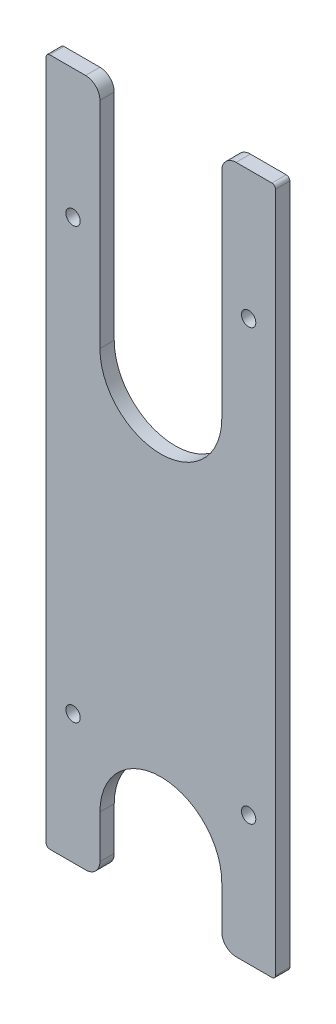
ISO-10303-21;
HEADER;
FILE_DESCRIPTION(('STEP AP214'),'2;1');
FILE_NAME('part.step','',(''),(''),'','','');
FILE_SCHEMA(('AUTOMOTIVE_DESIGN { 1 0 10303 214 1 1 1 1 }'));
ENDSEC;
DATA;
#1=APPLICATION_CONTEXT('core data for automotive mechanical design processes');
#2=APPLICATION_PROTOCOL_DEFINITION('international standard','automotive_design',2000,#1);
#3=PRODUCT_CONTEXT('',#1,'mechanical');
#4=PRODUCT('Part','Part','',(#3));
#5=PRODUCT_RELATED_PRODUCT_CATEGORY('part','',(#4));
#6=PRODUCT_DEFINITION_FORMATION('','',#4);
#7=PRODUCT_DEFINITION_CONTEXT('part definition',#1,'design');
#8=PRODUCT_DEFINITION('design','',#6,#7);
#9=PRODUCT_DEFINITION_SHAPE('','',#8);
#10=(LENGTH_UNIT() NAMED_UNIT(*) SI_UNIT(.MILLI.,.METRE.));
#11=(NAMED_UNIT(*) PLANE_ANGLE_UNIT() SI_UNIT($,.RADIAN.));
#12=(NAMED_UNIT(*) SI_UNIT($,.STERADIAN.) SOLID_ANGLE_UNIT());
#13=UNCERTAINTY_MEASURE_WITH_UNIT(LENGTH_MEASURE(1.E-05),#10,'distance_accuracy_value','');
#14=(GEOMETRIC_REPRESENTATION_CONTEXT(3) GLOBAL_UNCERTAINTY_ASSIGNED_CONTEXT((#13)) GLOBAL_UNIT_ASSIGNED_CONTEXT((#10,
#11,#12)) REPRESENTATION_CONTEXT('',''));
#15=CARTESIAN_POINT('',(0.,0.,0.));
#16=DIRECTION('',(0.,0.,1.));
#17=DIRECTION('',(1.,0.,0.));
#18=AXIS2_PLACEMENT_3D('',#15,#16,#17);
#19=CARTESIAN_POINT('',(26.9875,-152.4,6.35));
#20=DIRECTION('',(0.,1.,0.));
#21=DIRECTION('',(-1.,0.,0.));
#22=AXIS2_PLACEMENT_3D('',#19,#20,#21);
#23=PLANE('',#22);
#24=DIRECTION('',(1.,0.,0.));
#25=VECTOR('',#24,1.);
#26=CARTESIAN_POINT('',(26.9875,-152.4,0.));
#27=LINE('',#26,#25);
#28=CARTESIAN_POINT('',(33.3375,-152.4,0.));
#29=VERTEX_POINT('',#28);
#30=CARTESIAN_POINT('',(49.2124999999999,-152.4,0.));
#31=VERTEX_POINT('',#30);
#32=EDGE_CURVE('E303',#29,#31,#27,.T.);
#33=ORIENTED_EDGE('',*,*,#32,.T.);
#34=DIRECTION('',(0.,0.,-1.));
#35=VECTOR('',#34,1.);
#36=CARTESIAN_POINT('',(49.2124999999999,-152.4,6.35));
#37=LINE('',#36,#35);
#38=CARTESIAN_POINT('',(49.2124999999999,-152.4,6.35));
#39=VERTEX_POINT('',#38);
#40=EDGE_CURVE('E295',#31,#39,#37,.F.);
#41=ORIENTED_EDGE('',*,*,#40,.T.);
#42=DIRECTION('',(1.,0.,0.));
#43=VECTOR('',#42,1.);
#44=CARTESIAN_POINT('',(26.9875,-152.4,6.35));
#45=LINE('',#44,#43);
#46=CARTESIAN_POINT('',(33.3375,-152.4,6.35));
#47=VERTEX_POINT('',#46);
#48=EDGE_CURVE('E237',#47,#39,#45,.T.);
#49=ORIENTED_EDGE('',*,*,#48,.F.);
#50=DIRECTION('',(0.,0.,-1.));
#51=VECTOR('',#50,1.);
#52=CARTESIAN_POINT('',(33.3375,-152.4,6.35));
#53=LINE('',#52,#51);
#54=EDGE_CURVE('E195',#47,#29,#53,.T.);
#55=ORIENTED_EDGE('',*,*,#54,.T.);
#56=EDGE_LOOP('',(#33,#41,#49,#55));
#57=FACE_BOUND('',#56,.T.);
#58=ADVANCED_FACE('F36',(#57),#23,.F.);
#59=CARTESIAN_POINT('',(50.7999999999999,152.4,6.35));
#60=DIRECTION('',(-1.,0.,0.));
#61=DIRECTION('',(0.,0.,1.));
#62=AXIS2_PLACEMENT_3D('',#59,#60,#61);
#63=PLANE('',#62);
#64=DIRECTION('',(0.,1.,0.));
#65=VECTOR('',#64,1.);
#66=CARTESIAN_POINT('',(50.7999999999999,152.4,6.35));
#67=LINE('',#66,#65);
#68=CARTESIAN_POINT('',(50.7999999999999,-150.8125,6.35));
#69=VERTEX_POINT('',#68);
#70=CARTESIAN_POINT('',(50.7999999999999,150.8125,6.35));
#71=VERTEX_POINT('',#70);
#72=EDGE_CURVE('E234',#69,#71,#67,.T.);
#73=ORIENTED_EDGE('',*,*,#72,.F.);
#74=DIRECTION('',(0.,0.,-1.));
#75=VECTOR('',#74,1.);
#76=CARTESIAN_POINT('',(50.7999999999999,-150.8125,6.35));
#77=LINE('',#76,#75);
#78=CARTESIAN_POINT('',(50.7999999999999,-150.8125,0.));
#79=VERTEX_POINT('',#78);
#80=EDGE_CURVE('E292',#69,#79,#77,.T.);
#81=ORIENTED_EDGE('',*,*,#80,.T.);
#82=DIRECTION('',(0.,1.,0.));
#83=VECTOR('',#82,1.);
#84=CARTESIAN_POINT('',(50.7999999999999,152.4,0.));
#85=LINE('',#84,#83);
#86=CARTESIAN_POINT('',(50.7999999999999,150.8125,0.));
#87=VERTEX_POINT('',#86);
#88=EDGE_CURVE('E315',#79,#87,#85,.T.);
#89=ORIENTED_EDGE('',*,*,#88,.T.);
#90=DIRECTION('',(0.,0.,-1.));
#91=VECTOR('',#90,1.);
#92=CARTESIAN_POINT('',(50.7999999999999,150.8125,6.35));
#93=LINE('',#92,#91);
#94=EDGE_CURVE('E290',#87,#71,#93,.F.);
#95=ORIENTED_EDGE('',*,*,#94,.T.);
#96=EDGE_LOOP('',(#73,#81,#89,#95));
#97=FACE_BOUND('',#96,.T.);
#98=ADVANCED_FACE('F314',(#97),#63,.F.);
#99=CARTESIAN_POINT('',(26.9875,152.4,6.35));
#100=DIRECTION('',(0.,-1.,0.));
#101=DIRECTION('',(0.,0.,-1.));
#102=AXIS2_PLACEMENT_3D('',#99,#100,#101);
#103=PLANE('',#102);
#104=DIRECTION('',(-1.,0.,0.));
#105=VECTOR('',#104,1.);
#106=CARTESIAN_POINT('',(26.9875,152.4,6.35));
#107=LINE('',#106,#105);
#108=CARTESIAN_POINT('',(49.2124999999999,152.4,6.35));
#109=VERTEX_POINT('',#108);
#110=CARTESIAN_POINT('',(33.3375,152.4,6.35));
#111=VERTEX_POINT('',#110);
#112=EDGE_CURVE('E186',#109,#111,#107,.T.);
#113=ORIENTED_EDGE('',*,*,#112,.F.);
#114=DIRECTION('',(0.,0.,-1.));
#115=VECTOR('',#114,1.);
#116=CARTESIAN_POINT('',(49.2124999999999,152.4,6.35));
#117=LINE('',#116,#115);
#118=CARTESIAN_POINT('',(49.2124999999999,152.4,0.));
#119=VERTEX_POINT('',#118);
#120=EDGE_CURVE('E12',#109,#119,#117,.T.);
#121=ORIENTED_EDGE('',*,*,#120,.T.);
#122=DIRECTION('',(-1.,0.,0.));
#123=VECTOR('',#122,1.);
#124=CARTESIAN_POINT('',(26.9875,152.4,0.));
#125=LINE('',#124,#123);
#126=CARTESIAN_POINT('',(33.3375,152.4,0.));
#127=VERTEX_POINT('',#126);
#128=EDGE_CURVE('E321',#119,#127,#125,.T.);
#129=ORIENTED_EDGE('',*,*,#128,.T.);
#130=DIRECTION('',(0.,0.,-1.));
#131=VECTOR('',#130,1.);
#132=CARTESIAN_POINT('',(33.3375,152.4,6.35));
#133=LINE('',#132,#131);
#134=EDGE_CURVE('E259',#127,#111,#133,.F.);
#135=ORIENTED_EDGE('',*,*,#134,.T.);
#136=EDGE_LOOP('',(#113,#121,#129,#135));
#137=FACE_BOUND('',#136,.T.);
#138=ADVANCED_FACE('F391',(#137),#103,.F.);
#139=CARTESIAN_POINT('',(26.9875,50.8,6.35));
#140=DIRECTION('',(1.,0.,0.));
#141=DIRECTION('',(0.,1.,0.));
#142=AXIS2_PLACEMENT_3D('',#139,#140,#141);
#143=PLANE('',#142);
#144=DIRECTION('',(0.,-1.,0.));
#145=VECTOR('',#144,1.);
#146=CARTESIAN_POINT('',(26.9875,50.8,6.35));
#147=LINE('',#146,#145);
#148=CARTESIAN_POINT('',(26.9875,146.05,6.35));
#149=VERTEX_POINT('',#148);
#150=CARTESIAN_POINT('',(26.9875,50.8,6.35));
#151=VERTEX_POINT('',#150);
#152=EDGE_CURVE('E173',#149,#151,#147,.T.);
#153=ORIENTED_EDGE('',*,*,#152,.F.);
#154=DIRECTION('',(0.,0.,-1.));
#155=VECTOR('',#154,1.);
#156=CARTESIAN_POINT('',(26.9875,146.05,6.35));
#157=LINE('',#156,#155);
#158=CARTESIAN_POINT('',(26.9875,146.05,0.));
#159=VERTEX_POINT('',#158);
#160=EDGE_CURVE('E257',#149,#159,#157,.T.);
#161=ORIENTED_EDGE('',*,*,#160,.T.);
#162=DIRECTION('',(0.,-1.,0.));
#163=VECTOR('',#162,1.);
#164=CARTESIAN_POINT('',(26.9875,50.8,0.));
#165=LINE('',#164,#163);
#166=CARTESIAN_POINT('',(26.9875,50.8,0.));
#167=VERTEX_POINT('',#166);
#168=EDGE_CURVE('E192',#159,#167,#165,.T.);
#169=ORIENTED_EDGE('',*,*,#168,.T.);
#170=DIRECTION('',(0.,0.,-1.));
#171=VECTOR('',#170,1.);
#172=CARTESIAN_POINT('',(26.9875,50.8,6.35));
#173=LINE('',#172,#171);
#174=EDGE_CURVE('E189',#151,#167,#173,.T.);
#175=ORIENTED_EDGE('',*,*,#174,.F.);
#176=EDGE_LOOP('',(#153,#161,#169,#175));
#177=FACE_BOUND('',#176,.T.);
#178=ADVANCED_FACE('F190',(#177),#143,.F.);
#179=CARTESIAN_POINT('',(0.,50.8,6.35));
#180=DIRECTION('',(0.,0.,-1.));
#181=DIRECTION('',(-1.,0.,0.));
#182=AXIS2_PLACEMENT_3D('',#179,#180,#181);
#183=CYLINDRICAL_SURFACE('',#182,26.9875);
#184=CARTESIAN_POINT('',(0.,50.8,0.));
#185=DIRECTION('',(0.,0.,-1.));
#186=DIRECTION('',(1.,0.,0.));
#187=AXIS2_PLACEMENT_3D('',#184,#185,#186);
#188=CIRCLE('',#187,26.9875);
#189=CARTESIAN_POINT('',(-26.9875,50.8,0.));
#190=VERTEX_POINT('',#189);
#191=EDGE_CURVE('E327',#167,#190,#188,.T.);
#192=ORIENTED_EDGE('',*,*,#191,.T.);
#193=DIRECTION('',(0.,0.,-1.));
#194=VECTOR('',#193,1.);
#195=CARTESIAN_POINT('',(-26.9875,50.8,6.35));
#196=LINE('',#195,#194);
#197=CARTESIAN_POINT('',(-26.9875,50.8,6.35));
#198=VERTEX_POINT('',#197);
#199=EDGE_CURVE('E196',#198,#190,#196,.T.);
#200=ORIENTED_EDGE('',*,*,#199,.F.);
#201=CARTESIAN_POINT('',(0.,50.8,6.35));
#202=DIRECTION('',(0.,0.,-1.));
#203=DIRECTION('',(1.,0.,0.));
#204=AXIS2_PLACEMENT_3D('',#201,#202,#203);
#205=CIRCLE('',#204,26.9875);
#206=EDGE_CURVE('E179',#151,#198,#205,.T.);
#207=ORIENTED_EDGE('',*,*,#206,.F.);
#208=ORIENTED_EDGE('',*,*,#174,.T.);
#209=EDGE_LOOP('',(#192,#200,#207,#208));
#210=FACE_BOUND('',#209,.T.);
#211=ADVANCED_FACE('F198',(#210),#183,.F.);
#212=CARTESIAN_POINT('',(-26.9875,50.8,6.35));
#213=DIRECTION('',(-1.,0.,0.));
#214=DIRECTION('',(0.,-1.,0.));
#215=AXIS2_PLACEMENT_3D('',#212,#213,#214);
#216=PLANE('',#215);
#217=DIRECTION('',(0.,1.,0.));
#218=VECTOR('',#217,1.);
#219=CARTESIAN_POINT('',(-26.9875,50.8,0.));
#220=LINE('',#219,#218);
#221=CARTESIAN_POINT('',(-26.9875,146.05,0.));
#222=VERTEX_POINT('',#221);
#223=EDGE_CURVE('E329',#190,#222,#220,.T.);
#224=ORIENTED_EDGE('',*,*,#223,.T.);
#225=DIRECTION('',(0.,0.,-1.));
#226=VECTOR('',#225,1.);
#227=CARTESIAN_POINT('',(-26.9875,146.05,6.35));
#228=LINE('',#227,#226);
#229=CARTESIAN_POINT('',(-26.9875,146.05,6.35));
#230=VERTEX_POINT('',#229);
#231=EDGE_CURVE('E265',#222,#230,#228,.F.);
#232=ORIENTED_EDGE('',*,*,#231,.T.);
#233=DIRECTION('',(0.,1.,0.));
#234=VECTOR('',#233,1.);
#235=CARTESIAN_POINT('',(-26.9875,50.8,6.35));
#236=LINE('',#235,#234);
#237=EDGE_CURVE('E201',#198,#230,#236,.T.);
#238=ORIENTED_EDGE('',*,*,#237,.F.);
#239=ORIENTED_EDGE('',*,*,#199,.T.);
#240=EDGE_LOOP('',(#224,#232,#238,#239));
#241=FACE_BOUND('',#240,.T.);
#242=ADVANCED_FACE('F401',(#241),#216,.F.);
#243=CARTESIAN_POINT('',(-50.8,152.4,6.35));
#244=DIRECTION('',(0.,-1.,0.));
#245=DIRECTION('',(1.,0.,0.));
#246=AXIS2_PLACEMENT_3D('',#243,#244,#245);
#247=PLANE('',#246);
#248=DIRECTION('',(-1.,0.,0.));
#249=VECTOR('',#248,1.);
#250=CARTESIAN_POINT('',(-50.8,152.4,0.));
#251=LINE('',#250,#249);
#252=CARTESIAN_POINT('',(-33.3375,152.4,0.));
#253=VERTEX_POINT('',#252);
#254=CARTESIAN_POINT('',(-49.2125,152.4,0.));
#255=VERTEX_POINT('',#254);
#256=EDGE_CURVE('E332',#253,#255,#251,.T.);
#257=ORIENTED_EDGE('',*,*,#256,.T.);
#258=DIRECTION('',(0.,0.,-1.));
#259=VECTOR('',#258,1.);
#260=CARTESIAN_POINT('',(-49.2125,152.4,6.35));
#261=LINE('',#260,#259);
#262=CARTESIAN_POINT('',(-49.2125,152.4,6.35));
#263=VERTEX_POINT('',#262);
#264=EDGE_CURVE('E44',#255,#263,#261,.F.);
#265=ORIENTED_EDGE('',*,*,#264,.T.);
#266=DIRECTION('',(-1.,0.,0.));
#267=VECTOR('',#266,1.);
#268=CARTESIAN_POINT('',(-50.8,152.4,6.35));
#269=LINE('',#268,#267);
#270=CARTESIAN_POINT('',(-33.3375,152.4,6.35));
#271=VERTEX_POINT('',#270);
#272=EDGE_CURVE('E203',#271,#263,#269,.T.);
#273=ORIENTED_EDGE('',*,*,#272,.F.);
#274=DIRECTION('',(0.,0.,-1.));
#275=VECTOR('',#274,1.);
#276=CARTESIAN_POINT('',(-33.3375,152.4,6.35));
#277=LINE('',#276,#275);
#278=EDGE_CURVE('E262',#271,#253,#277,.T.);
#279=ORIENTED_EDGE('',*,*,#278,.T.);
#280=EDGE_LOOP('',(#257,#265,#273,#279));
#281=FACE_BOUND('',#280,.T.);
#282=ADVANCED_FACE('F404',(#281),#247,.F.);
#283=CARTESIAN_POINT('',(-50.8,152.4,6.35));
#284=DIRECTION('',(1.,0.,0.));
#285=DIRECTION('',(0.,0.,-1.));
#286=AXIS2_PLACEMENT_3D('',#283,#284,#285);
#287=PLANE('',#286);
#288=DIRECTION('',(0.,-1.,0.));
#289=VECTOR('',#288,1.);
#290=CARTESIAN_POINT('',(-50.8,152.4,0.));
#291=LINE('',#290,#289);
#292=CARTESIAN_POINT('',(-50.8,150.8125,0.));
#293=VERTEX_POINT('',#292);
#294=CARTESIAN_POINT('',(-50.8,-150.8125,0.));
#295=VERTEX_POINT('',#294);
#296=EDGE_CURVE('E334',#293,#295,#291,.T.);
#297=ORIENTED_EDGE('',*,*,#296,.T.);
#298=DIRECTION('',(0.,0.,-1.));
#299=VECTOR('',#298,1.);
#300=CARTESIAN_POINT('',(-50.8,-150.8125,6.35));
#301=LINE('',#300,#299);
#302=CARTESIAN_POINT('',(-50.8,-150.8125,6.35));
#303=VERTEX_POINT('',#302);
#304=EDGE_CURVE('E281',#295,#303,#301,.F.);
#305=ORIENTED_EDGE('',*,*,#304,.T.);
#306=DIRECTION('',(0.,-1.,0.));
#307=VECTOR('',#306,1.);
#308=CARTESIAN_POINT('',(-50.8,152.4,6.35));
#309=LINE('',#308,#307);
#310=CARTESIAN_POINT('',(-50.8,150.8125,6.35));
#311=VERTEX_POINT('',#310);
#312=EDGE_CURVE('E649',#311,#303,#309,.T.);
#313=ORIENTED_EDGE('',*,*,#312,.F.);
#314=DIRECTION('',(0.,0.,-1.));
#315=VECTOR('',#314,1.);
#316=CARTESIAN_POINT('',(-50.8,150.8125,6.35));
#317=LINE('',#316,#315);
#318=EDGE_CURVE('E278',#311,#293,#317,.T.);
#319=ORIENTED_EDGE('',*,*,#318,.T.);
#320=EDGE_LOOP('',(#297,#305,#313,#319));
#321=FACE_BOUND('',#320,.T.);
#322=ADVANCED_FACE('F408',(#321),#287,.F.);
#323=CARTESIAN_POINT('',(-50.8,-152.4,6.35));
#324=DIRECTION('',(0.,1.,0.));
#325=DIRECTION('',(-1.,0.,0.));
#326=AXIS2_PLACEMENT_3D('',#323,#324,#325);
#327=PLANE('',#326);
#328=DIRECTION('',(1.,0.,0.));
#329=VECTOR('',#328,1.);
#330=CARTESIAN_POINT('',(-50.8,-152.4,6.35));
#331=LINE('',#330,#329);
#332=CARTESIAN_POINT('',(-49.2125,-152.4,6.35));
#333=VERTEX_POINT('',#332);
#334=CARTESIAN_POINT('',(-33.3375,-152.4,6.35));
#335=VERTEX_POINT('',#334);
#336=EDGE_CURVE('E651',#333,#335,#331,.T.);
#337=ORIENTED_EDGE('',*,*,#336,.F.);
#338=DIRECTION('',(0.,0.,-1.));
#339=VECTOR('',#338,1.);
#340=CARTESIAN_POINT('',(-49.2125,-152.4,6.35));
#341=LINE('',#340,#339);
#342=CARTESIAN_POINT('',(-49.2125,-152.4,0.));
#343=VERTEX_POINT('',#342);
#344=EDGE_CURVE('E267',#333,#343,#341,.T.);
#345=ORIENTED_EDGE('',*,*,#344,.T.);
#346=DIRECTION('',(1.,0.,0.));
#347=VECTOR('',#346,1.);
#348=CARTESIAN_POINT('',(-50.8,-152.4,0.));
#349=LINE('',#348,#347);
#350=CARTESIAN_POINT('',(-33.3375,-152.4,0.));
#351=VERTEX_POINT('',#350);
#352=EDGE_CURVE('E337',#343,#351,#349,.T.);
#353=ORIENTED_EDGE('',*,*,#352,.T.);
#354=DIRECTION('',(0.,0.,-1.));
#355=VECTOR('',#354,1.);
#356=CARTESIAN_POINT('',(-33.3375,-152.4,6.35));
#357=LINE('',#356,#355);
#358=EDGE_CURVE('E254',#351,#335,#357,.F.);
#359=ORIENTED_EDGE('',*,*,#358,.T.);
#360=EDGE_LOOP('',(#337,#345,#353,#359));
#361=FACE_BOUND('',#360,.T.);
#362=ADVANCED_FACE('F411',(#361),#327,.F.);
#363=CARTESIAN_POINT('',(-26.9875,-127.,6.35));
#364=DIRECTION('',(-1.,0.,0.));
#365=DIRECTION('',(0.,-1.,0.));
#366=AXIS2_PLACEMENT_3D('',#363,#364,#365);
#367=PLANE('',#366);
#368=DIRECTION('',(0.,1.,0.));
#369=VECTOR('',#368,1.);
#370=CARTESIAN_POINT('',(-26.9875,-127.,6.35));
#371=LINE('',#370,#369);
#372=CARTESIAN_POINT('',(-26.9875,-146.05,6.35));
#373=VERTEX_POINT('',#372);
#374=CARTESIAN_POINT('',(-26.9875,-127.,6.35));
#375=VERTEX_POINT('',#374);
#376=EDGE_CURVE('E653',#373,#375,#371,.T.);
#377=ORIENTED_EDGE('',*,*,#376,.F.);
#378=DIRECTION('',(0.,0.,-1.));
#379=VECTOR('',#378,1.);
#380=CARTESIAN_POINT('',(-26.9875,-146.05,6.35));
#381=LINE('',#380,#379);
#382=CARTESIAN_POINT('',(-26.9875,-146.05,0.));
#383=VERTEX_POINT('',#382);
#384=EDGE_CURVE('E251',#373,#383,#381,.T.);
#385=ORIENTED_EDGE('',*,*,#384,.T.);
#386=DIRECTION('',(0.,1.,0.));
#387=VECTOR('',#386,1.);
#388=CARTESIAN_POINT('',(-26.9875,-127.,0.));
#389=LINE('',#388,#387);
#390=CARTESIAN_POINT('',(-26.9875,-127.,0.));
#391=VERTEX_POINT('',#390);
#392=EDGE_CURVE('E339',#383,#391,#389,.T.);
#393=ORIENTED_EDGE('',*,*,#392,.T.);
#394=DIRECTION('',(0.,0.,-1.));
#395=VECTOR('',#394,1.);
#396=CARTESIAN_POINT('',(-26.9875,-127.,6.35));
#397=LINE('',#396,#395);
#398=EDGE_CURVE('E348',#375,#391,#397,.T.);
#399=ORIENTED_EDGE('',*,*,#398,.F.);
#400=EDGE_LOOP('',(#377,#385,#393,#399));
#401=FACE_BOUND('',#400,.T.);
#402=ADVANCED_FACE('F415',(#401),#367,.F.);
#403=CARTESIAN_POINT('',(0.,-127.,6.35));
#404=DIRECTION('',(0.,0.,-1.));
#405=DIRECTION('',(-1.,0.,0.));
#406=AXIS2_PLACEMENT_3D('',#403,#404,#405);
#407=CYLINDRICAL_SURFACE('',#406,26.9875);
#408=CARTESIAN_POINT('',(0.,-127.,0.));
#409=DIRECTION('',(0.,0.,-1.));
#410=DIRECTION('',(1.,0.,0.));
#411=AXIS2_PLACEMENT_3D('',#408,#409,#410);
#412=CIRCLE('',#411,26.9875);
#413=CARTESIAN_POINT('',(26.9875,-127.,0.));
#414=VERTEX_POINT('',#413);
#415=EDGE_CURVE('E341',#391,#414,#412,.T.);
#416=ORIENTED_EDGE('',*,*,#415,.T.);
#417=DIRECTION('',(0.,0.,-1.));
#418=VECTOR('',#417,1.);
#419=CARTESIAN_POINT('',(26.9875,-127.,6.35));
#420=LINE('',#419,#418);
#421=CARTESIAN_POINT('',(26.9875,-127.,6.35));
#422=VERTEX_POINT('',#421);
#423=EDGE_CURVE('E345',#422,#414,#420,.T.);
#424=ORIENTED_EDGE('',*,*,#423,.F.);
#425=CARTESIAN_POINT('',(0.,-127.,6.35));
#426=DIRECTION('',(0.,0.,-1.));
#427=DIRECTION('',(1.,0.,0.));
#428=AXIS2_PLACEMENT_3D('',#425,#426,#427);
#429=CIRCLE('',#428,26.9875);
#430=EDGE_CURVE('E369',#375,#422,#429,.T.);
#431=ORIENTED_EDGE('',*,*,#430,.F.);
#432=ORIENTED_EDGE('',*,*,#398,.T.);
#433=EDGE_LOOP('',(#416,#424,#431,#432));
#434=FACE_BOUND('',#433,.T.);
#435=ADVANCED_FACE('F419',(#434),#407,.F.);
#436=CARTESIAN_POINT('',(26.9875,-127.,6.35));
#437=DIRECTION('',(1.,0.,0.));
#438=DIRECTION('',(0.,1.,0.));
#439=AXIS2_PLACEMENT_3D('',#436,#437,#438);
#440=PLANE('',#439);
#441=DIRECTION('',(0.,-1.,0.));
#442=VECTOR('',#441,1.);
#443=CARTESIAN_POINT('',(26.9875,-127.,0.));
#444=LINE('',#443,#442);
#445=CARTESIAN_POINT('',(26.9875,-146.05,0.));
#446=VERTEX_POINT('',#445);
#447=EDGE_CURVE('E241',#414,#446,#444,.T.);
#448=ORIENTED_EDGE('',*,*,#447,.T.);
#449=DIRECTION('',(0.,0.,-1.));
#450=VECTOR('',#449,1.);
#451=CARTESIAN_POINT('',(26.9875,-146.05,6.35));
#452=LINE('',#451,#450);
#453=CARTESIAN_POINT('',(26.9875,-146.05,6.35));
#454=VERTEX_POINT('',#453);
#455=EDGE_CURVE('E222',#446,#454,#452,.F.);
#456=ORIENTED_EDGE('',*,*,#455,.T.);
#457=DIRECTION('',(0.,-1.,0.));
#458=VECTOR('',#457,1.);
#459=CARTESIAN_POINT('',(26.9875,-127.,6.35));
#460=LINE('',#459,#458);
#461=EDGE_CURVE('E349',#422,#454,#460,.T.);
#462=ORIENTED_EDGE('',*,*,#461,.F.);
#463=ORIENTED_EDGE('',*,*,#423,.T.);
#464=EDGE_LOOP('',(#448,#456,#462,#463));
#465=FACE_BOUND('',#464,.T.);
#466=ADVANCED_FACE('F366',(#465),#440,.F.);
#467=CARTESIAN_POINT('',(0.,50.8,6.35));
#468=DIRECTION('',(0.,0.,1.));
#469=DIRECTION('',(1.,0.,0.));
#470=AXIS2_PLACEMENT_3D('',#467,#468,#469);
#471=PLANE('',#470);
#472=CARTESIAN_POINT('',(-38.89375,95.25,6.35));
#473=DIRECTION('',(0.,0.,1.));
#474=DIRECTION('',(1.,0.,0.));
#475=AXIS2_PLACEMENT_3D('',#472,#473,#474);
#476=CIRCLE('',#475,3.175);
#477=CARTESIAN_POINT('',(-35.71875,95.25,6.35));
#478=VERTEX_POINT('',#477);
#479=EDGE_CURVE('E457',#478,#478,#476,.T.);
#480=ORIENTED_EDGE('',*,*,#479,.F.);
#481=EDGE_LOOP('',(#480));
#482=FACE_BOUND('',#481,.T.);
#483=CARTESIAN_POINT('',(38.89375,95.25,6.35));
#484=DIRECTION('',(0.,0.,1.));
#485=DIRECTION('',(1.,0.,0.));
#486=AXIS2_PLACEMENT_3D('',#483,#484,#485);
#487=CIRCLE('',#486,3.175);
#488=CARTESIAN_POINT('',(42.06875,95.25,6.35));
#489=VERTEX_POINT('',#488);
#490=EDGE_CURVE('E450',#489,#489,#487,.T.);
#491=ORIENTED_EDGE('',*,*,#490,.F.);
#492=EDGE_LOOP('',(#491));
#493=FACE_BOUND('',#492,.T.);
#494=CARTESIAN_POINT('',(38.89375,-95.25,6.35));
#495=DIRECTION('',(0.,0.,1.));
#496=DIRECTION('',(1.,0.,0.));
#497=AXIS2_PLACEMENT_3D('',#494,#495,#496);
#498=CIRCLE('',#497,3.175);
#499=CARTESIAN_POINT('',(42.06875,-95.25,6.35));
#500=VERTEX_POINT('',#499);
#501=EDGE_CURVE('E454',#500,#500,#498,.T.);
#502=ORIENTED_EDGE('',*,*,#501,.F.);
#503=EDGE_LOOP('',(#502));
#504=FACE_BOUND('',#503,.T.);
#505=CARTESIAN_POINT('',(-38.89375,-95.25,6.35));
#506=DIRECTION('',(0.,0.,1.));
#507=DIRECTION('',(1.,0.,0.));
#508=AXIS2_PLACEMENT_3D('',#505,#506,#507);
#509=CIRCLE('',#508,3.175);
#510=CARTESIAN_POINT('',(-35.71875,-95.25,6.35));
#511=VERTEX_POINT('',#510);
#512=EDGE_CURVE('E470',#511,#511,#509,.T.);
#513=ORIENTED_EDGE('',*,*,#512,.F.);
#514=EDGE_LOOP('',(#513));
#515=FACE_BOUND('',#514,.T.);
#516=ORIENTED_EDGE('',*,*,#312,.T.);
#517=CARTESIAN_POINT('',(-49.2125,-150.8125,6.35));
#518=DIRECTION('',(0.,0.,1.));
#519=DIRECTION('',(1.,0.,0.));
#520=AXIS2_PLACEMENT_3D('',#517,#518,#519);
#521=CIRCLE('',#520,1.5875);
#522=EDGE_CURVE('E288',#303,#333,#521,.T.);
#523=ORIENTED_EDGE('',*,*,#522,.T.);
#524=ORIENTED_EDGE('',*,*,#336,.T.);
#525=CARTESIAN_POINT('',(-33.3375,-146.05,6.35));
#526=DIRECTION('',(0.,0.,1.));
#527=DIRECTION('',(1.,0.,0.));
#528=AXIS2_PLACEMENT_3D('',#525,#526,#527);
#529=CIRCLE('',#528,6.35);
#530=EDGE_CURVE('E226',#335,#373,#529,.T.);
#531=ORIENTED_EDGE('',*,*,#530,.T.);
#532=ORIENTED_EDGE('',*,*,#376,.T.);
#533=ORIENTED_EDGE('',*,*,#430,.T.);
#534=ORIENTED_EDGE('',*,*,#461,.T.);
#535=CARTESIAN_POINT('',(33.3375,-146.05,6.35));
#536=DIRECTION('',(0.,0.,1.));
#537=DIRECTION('',(1.,0.,0.));
#538=AXIS2_PLACEMENT_3D('',#535,#536,#537);
#539=CIRCLE('',#538,6.35);
#540=EDGE_CURVE('E248',#454,#47,#539,.T.);
#541=ORIENTED_EDGE('',*,*,#540,.T.);
#542=ORIENTED_EDGE('',*,*,#48,.T.);
#543=CARTESIAN_POINT('',(49.2124999999999,-150.8125,6.35));
#544=DIRECTION('',(0.,0.,1.));
#545=DIRECTION('',(1.,0.,0.));
#546=AXIS2_PLACEMENT_3D('',#543,#544,#545);
#547=CIRCLE('',#546,1.5875);
#548=EDGE_CURVE('E286',#39,#69,#547,.T.);
#549=ORIENTED_EDGE('',*,*,#548,.T.);
#550=ORIENTED_EDGE('',*,*,#72,.T.);
#551=CARTESIAN_POINT('',(49.2124999999999,150.8125,6.35));
#552=DIRECTION('',(0.,0.,1.));
#553=DIRECTION('',(1.,0.,0.));
#554=AXIS2_PLACEMENT_3D('',#551,#552,#553);
#555=CIRCLE('',#554,1.5875);
#556=EDGE_CURVE('E58',#71,#109,#555,.T.);
#557=ORIENTED_EDGE('',*,*,#556,.T.);
#558=ORIENTED_EDGE('',*,*,#112,.T.);
#559=CARTESIAN_POINT('',(33.3375,146.05,6.35));
#560=DIRECTION('',(0.,0.,1.));
#561=DIRECTION('',(1.,0.,0.));
#562=AXIS2_PLACEMENT_3D('',#559,#560,#561);
#563=CIRCLE('',#562,6.35);
#564=EDGE_CURVE('E182',#111,#149,#563,.T.);
#565=ORIENTED_EDGE('',*,*,#564,.T.);
#566=ORIENTED_EDGE('',*,*,#152,.T.);
#567=ORIENTED_EDGE('',*,*,#206,.T.);
#568=ORIENTED_EDGE('',*,*,#237,.T.);
#569=CARTESIAN_POINT('',(-33.3375,146.05,6.35));
#570=DIRECTION('',(0.,0.,1.));
#571=DIRECTION('',(1.,0.,0.));
#572=AXIS2_PLACEMENT_3D('',#569,#570,#571);
#573=CIRCLE('',#572,6.35);
#574=EDGE_CURVE('E218',#230,#271,#573,.T.);
#575=ORIENTED_EDGE('',*,*,#574,.T.);
#576=ORIENTED_EDGE('',*,*,#272,.T.);
#577=CARTESIAN_POINT('',(-49.2125,150.8125,6.35));
#578=DIRECTION('',(0.,0.,1.));
#579=DIRECTION('',(1.,0.,0.));
#580=AXIS2_PLACEMENT_3D('',#577,#578,#579);
#581=CIRCLE('',#580,1.5875);
#582=EDGE_CURVE('E284',#263,#311,#581,.T.);
#583=ORIENTED_EDGE('',*,*,#582,.T.);
#584=EDGE_LOOP('',(#516,#523,#524,#531,#532,#533,#534,#541,#542,#549,#550,#557,#558,#565,#566,
#567,#568,#575,#576,#583));
#585=FACE_BOUND('',#584,.T.);
#586=ADVANCED_FACE('F176',(#482,#493,#504,#515,#585),#471,.T.);
#587=CARTESIAN_POINT('',(0.,50.8,0.));
#588=DIRECTION('',(0.,0.,1.));
#589=DIRECTION('',(1.,0.,0.));
#590=AXIS2_PLACEMENT_3D('',#587,#588,#589);
#591=PLANE('',#590);
#592=CARTESIAN_POINT('',(-38.89375,95.25,0.));
#593=DIRECTION('',(0.,0.,1.));
#594=DIRECTION('',(1.,0.,0.));
#595=AXIS2_PLACEMENT_3D('',#592,#593,#594);
#596=CIRCLE('',#595,3.175);
#597=CARTESIAN_POINT('',(-35.71875,95.25,0.));
#598=VERTEX_POINT('',#597);
#599=EDGE_CURVE('E452',#598,#598,#596,.T.);
#600=ORIENTED_EDGE('',*,*,#599,.T.);
#601=EDGE_LOOP('',(#600));
#602=FACE_BOUND('',#601,.T.);
#603=CARTESIAN_POINT('',(38.89375,95.25,0.));
#604=DIRECTION('',(0.,0.,1.));
#605=DIRECTION('',(1.,0.,0.));
#606=AXIS2_PLACEMENT_3D('',#603,#604,#605);
#607=CIRCLE('',#606,3.175);
#608=CARTESIAN_POINT('',(42.06875,95.25,0.));
#609=VERTEX_POINT('',#608);
#610=EDGE_CURVE('E447',#609,#609,#607,.T.);
#611=ORIENTED_EDGE('',*,*,#610,.T.);
#612=EDGE_LOOP('',(#611));
#613=FACE_BOUND('',#612,.T.);
#614=CARTESIAN_POINT('',(38.89375,-95.25,0.));
#615=DIRECTION('',(0.,0.,1.));
#616=DIRECTION('',(1.,0.,0.));
#617=AXIS2_PLACEMENT_3D('',#614,#615,#616);
#618=CIRCLE('',#617,3.175);
#619=CARTESIAN_POINT('',(42.06875,-95.25,0.));
#620=VERTEX_POINT('',#619);
#621=EDGE_CURVE('E468',#620,#620,#618,.T.);
#622=ORIENTED_EDGE('',*,*,#621,.T.);
#623=EDGE_LOOP('',(#622));
#624=FACE_BOUND('',#623,.T.);
#625=CARTESIAN_POINT('',(-38.89375,-95.25,0.));
#626=DIRECTION('',(0.,0.,1.));
#627=DIRECTION('',(1.,0.,0.));
#628=AXIS2_PLACEMENT_3D('',#625,#626,#627);
#629=CIRCLE('',#628,3.175);
#630=CARTESIAN_POINT('',(-35.71875,-95.25,0.));
#631=VERTEX_POINT('',#630);
#632=EDGE_CURVE('E242',#631,#631,#629,.T.);
#633=ORIENTED_EDGE('',*,*,#632,.T.);
#634=EDGE_LOOP('',(#633));
#635=FACE_BOUND('',#634,.T.);
#636=ORIENTED_EDGE('',*,*,#352,.F.);
#637=CARTESIAN_POINT('',(-49.2125,-150.8125,0.));
#638=DIRECTION('',(0.,0.,1.));
#639=DIRECTION('',(1.,0.,0.));
#640=AXIS2_PLACEMENT_3D('',#637,#638,#639);
#641=CIRCLE('',#640,1.5875);
#642=EDGE_CURVE('E276',#343,#295,#641,.F.);
#643=ORIENTED_EDGE('',*,*,#642,.T.);
#644=ORIENTED_EDGE('',*,*,#296,.F.);
#645=CARTESIAN_POINT('',(-49.2125,150.8125,0.));
#646=DIRECTION('',(0.,0.,1.));
#647=DIRECTION('',(1.,0.,0.));
#648=AXIS2_PLACEMENT_3D('',#645,#646,#647);
#649=CIRCLE('',#648,1.5875);
#650=EDGE_CURVE('E272',#293,#255,#649,.F.);
#651=ORIENTED_EDGE('',*,*,#650,.T.);
#652=ORIENTED_EDGE('',*,*,#256,.F.);
#653=CARTESIAN_POINT('',(-33.3375,146.05,0.));
#654=DIRECTION('',(0.,0.,1.));
#655=DIRECTION('',(1.,0.,0.));
#656=AXIS2_PLACEMENT_3D('',#653,#654,#655);
#657=CIRCLE('',#656,6.35);
#658=EDGE_CURVE('E354',#253,#222,#657,.F.);
#659=ORIENTED_EDGE('',*,*,#658,.T.);
#660=ORIENTED_EDGE('',*,*,#223,.F.);
#661=ORIENTED_EDGE('',*,*,#191,.F.);
#662=ORIENTED_EDGE('',*,*,#168,.F.);
#663=CARTESIAN_POINT('',(33.3375,146.05,0.));
#664=DIRECTION('',(0.,0.,1.));
#665=DIRECTION('',(1.,0.,0.));
#666=AXIS2_PLACEMENT_3D('',#663,#664,#665);
#667=CIRCLE('',#666,6.35);
#668=EDGE_CURVE('E356',#159,#127,#667,.F.);
#669=ORIENTED_EDGE('',*,*,#668,.T.);
#670=ORIENTED_EDGE('',*,*,#128,.F.);
#671=CARTESIAN_POINT('',(49.2124999999999,150.8125,0.));
#672=DIRECTION('',(0.,0.,1.));
#673=DIRECTION('',(1.,0.,0.));
#674=AXIS2_PLACEMENT_3D('',#671,#672,#673);
#675=CIRCLE('',#674,1.5875);
#676=EDGE_CURVE('E270',#119,#87,#675,.F.);
#677=ORIENTED_EDGE('',*,*,#676,.T.);
#678=ORIENTED_EDGE('',*,*,#88,.F.);
#679=CARTESIAN_POINT('',(49.2124999999999,-150.8125,0.));
#680=DIRECTION('',(0.,0.,1.));
#681=DIRECTION('',(1.,0.,0.));
#682=AXIS2_PLACEMENT_3D('',#679,#680,#681);
#683=CIRCLE('',#682,1.5875);
#684=EDGE_CURVE('E274',#79,#31,#683,.F.);
#685=ORIENTED_EDGE('',*,*,#684,.T.);
#686=ORIENTED_EDGE('',*,*,#32,.F.);
#687=CARTESIAN_POINT('',(33.3375,-146.05,0.));
#688=DIRECTION('',(0.,0.,1.));
#689=DIRECTION('',(1.,0.,0.));
#690=AXIS2_PLACEMENT_3D('',#687,#688,#689);
#691=CIRCLE('',#690,6.35);
#692=EDGE_CURVE('E361',#29,#446,#691,.F.);
#693=ORIENTED_EDGE('',*,*,#692,.T.);
#694=ORIENTED_EDGE('',*,*,#447,.F.);
#695=ORIENTED_EDGE('',*,*,#415,.F.);
#696=ORIENTED_EDGE('',*,*,#392,.F.);
#697=CARTESIAN_POINT('',(-33.3375,-146.05,0.));
#698=DIRECTION('',(0.,0.,1.));
#699=DIRECTION('',(1.,0.,0.));
#700=AXIS2_PLACEMENT_3D('',#697,#698,#699);
#701=CIRCLE('',#700,6.35);
#702=EDGE_CURVE('E359',#383,#351,#701,.F.);
#703=ORIENTED_EDGE('',*,*,#702,.T.);
#704=EDGE_LOOP('',(#636,#643,#644,#651,#652,#659,#660,#661,#662,#669,#670,#677,#678,#685,#686,
#693,#694,#695,#696,#703));
#705=FACE_BOUND('',#704,.T.);
#706=ADVANCED_FACE('F319',(#602,#613,#624,#635,#705),#591,.F.);
#707=CARTESIAN_POINT('',(-38.89375,-95.25,6.35));
#708=DIRECTION('',(0.,0.,1.));
#709=DIRECTION('',(1.,0.,0.));
#710=AXIS2_PLACEMENT_3D('',#707,#708,#709);
#711=CYLINDRICAL_SURFACE('',#710,3.175);
#712=ORIENTED_EDGE('',*,*,#632,.F.);
#713=EDGE_LOOP('',(#712));
#714=FACE_BOUND('',#713,.T.);
#715=ORIENTED_EDGE('',*,*,#512,.T.);
#716=EDGE_LOOP('',(#715));
#717=FACE_BOUND('',#716,.T.);
#718=ADVANCED_FACE('F428',(#714,#717),#711,.F.);
#719=CARTESIAN_POINT('',(38.89375,-95.25,6.35));
#720=DIRECTION('',(0.,0.,1.));
#721=DIRECTION('',(1.,0.,0.));
#722=AXIS2_PLACEMENT_3D('',#719,#720,#721);
#723=CYLINDRICAL_SURFACE('',#722,3.175);
#724=ORIENTED_EDGE('',*,*,#621,.F.);
#725=EDGE_LOOP('',(#724));
#726=FACE_BOUND('',#725,.T.);
#727=ORIENTED_EDGE('',*,*,#501,.T.);
#728=EDGE_LOOP('',(#727));
#729=FACE_BOUND('',#728,.T.);
#730=ADVANCED_FACE('F435',(#726,#729),#723,.F.);
#731=CARTESIAN_POINT('',(38.89375,95.25,6.35));
#732=DIRECTION('',(0.,0.,1.));
#733=DIRECTION('',(1.,0.,0.));
#734=AXIS2_PLACEMENT_3D('',#731,#732,#733);
#735=CYLINDRICAL_SURFACE('',#734,3.175);
#736=ORIENTED_EDGE('',*,*,#610,.F.);
#737=EDGE_LOOP('',(#736));
#738=FACE_BOUND('',#737,.T.);
#739=ORIENTED_EDGE('',*,*,#490,.T.);
#740=EDGE_LOOP('',(#739));
#741=FACE_BOUND('',#740,.T.);
#742=ADVANCED_FACE('F383',(#738,#741),#735,.F.);
#743=CARTESIAN_POINT('',(-38.89375,95.25,6.35));
#744=DIRECTION('',(0.,0.,1.));
#745=DIRECTION('',(1.,0.,0.));
#746=AXIS2_PLACEMENT_3D('',#743,#744,#745);
#747=CYLINDRICAL_SURFACE('',#746,3.175);
#748=ORIENTED_EDGE('',*,*,#599,.F.);
#749=EDGE_LOOP('',(#748));
#750=FACE_BOUND('',#749,.T.);
#751=ORIENTED_EDGE('',*,*,#479,.T.);
#752=EDGE_LOOP('',(#751));
#753=FACE_BOUND('',#752,.T.);
#754=ADVANCED_FACE('F374',(#750,#753),#747,.F.);
#755=CARTESIAN_POINT('',(33.3375,-146.05,6.35));
#756=DIRECTION('',(0.,0.,-1.));
#757=DIRECTION('',(-1.,0.,0.));
#758=AXIS2_PLACEMENT_3D('',#755,#756,#757);
#759=CYLINDRICAL_SURFACE('',#758,6.35);
#760=ORIENTED_EDGE('',*,*,#540,.F.);
#761=ORIENTED_EDGE('',*,*,#455,.F.);
#762=ORIENTED_EDGE('',*,*,#692,.F.);
#763=ORIENTED_EDGE('',*,*,#54,.F.);
#764=EDGE_LOOP('',(#760,#761,#762,#763));
#765=FACE_BOUND('',#764,.T.);
#766=ADVANCED_FACE('F371',(#765),#759,.T.);
#767=CARTESIAN_POINT('',(-33.3375,-146.05,6.35));
#768=DIRECTION('',(0.,0.,-1.));
#769=DIRECTION('',(-1.,0.,0.));
#770=AXIS2_PLACEMENT_3D('',#767,#768,#769);
#771=CYLINDRICAL_SURFACE('',#770,6.35);
#772=ORIENTED_EDGE('',*,*,#530,.F.);
#773=ORIENTED_EDGE('',*,*,#358,.F.);
#774=ORIENTED_EDGE('',*,*,#702,.F.);
#775=ORIENTED_EDGE('',*,*,#384,.F.);
#776=EDGE_LOOP('',(#772,#773,#774,#775));
#777=FACE_BOUND('',#776,.T.);
#778=ADVANCED_FACE('F373',(#777),#771,.T.);
#779=CARTESIAN_POINT('',(33.3375,146.05,6.35));
#780=DIRECTION('',(0.,0.,-1.));
#781=DIRECTION('',(-1.,0.,0.));
#782=AXIS2_PLACEMENT_3D('',#779,#780,#781);
#783=CYLINDRICAL_SURFACE('',#782,6.35);
#784=ORIENTED_EDGE('',*,*,#564,.F.);
#785=ORIENTED_EDGE('',*,*,#134,.F.);
#786=ORIENTED_EDGE('',*,*,#668,.F.);
#787=ORIENTED_EDGE('',*,*,#160,.F.);
#788=EDGE_LOOP('',(#784,#785,#786,#787));
#789=FACE_BOUND('',#788,.T.);
#790=ADVANCED_FACE('F380',(#789),#783,.T.);
#791=CARTESIAN_POINT('',(-33.3375,146.05,6.35));
#792=DIRECTION('',(0.,0.,-1.));
#793=DIRECTION('',(-1.,0.,0.));
#794=AXIS2_PLACEMENT_3D('',#791,#792,#793);
#795=CYLINDRICAL_SURFACE('',#794,6.35);
#796=ORIENTED_EDGE('',*,*,#574,.F.);
#797=ORIENTED_EDGE('',*,*,#231,.F.);
#798=ORIENTED_EDGE('',*,*,#658,.F.);
#799=ORIENTED_EDGE('',*,*,#278,.F.);
#800=EDGE_LOOP('',(#796,#797,#798,#799));
#801=FACE_BOUND('',#800,.T.);
#802=ADVANCED_FACE('F545',(#801),#795,.T.);
#803=CARTESIAN_POINT('',(-49.2125,-150.8125,6.35));
#804=DIRECTION('',(0.,0.,-1.));
#805=DIRECTION('',(-1.,0.,0.));
#806=AXIS2_PLACEMENT_3D('',#803,#804,#805);
#807=CYLINDRICAL_SURFACE('',#806,1.5875);
#808=ORIENTED_EDGE('',*,*,#522,.F.);
#809=ORIENTED_EDGE('',*,*,#304,.F.);
#810=ORIENTED_EDGE('',*,*,#642,.F.);
#811=ORIENTED_EDGE('',*,*,#344,.F.);
#812=EDGE_LOOP('',(#808,#809,#810,#811));
#813=FACE_BOUND('',#812,.T.);
#814=ADVANCED_FACE('F554',(#813),#807,.T.);
#815=CARTESIAN_POINT('',(49.2124999999999,-150.8125,6.35));
#816=DIRECTION('',(0.,0.,-1.));
#817=DIRECTION('',(-1.,0.,0.));
#818=AXIS2_PLACEMENT_3D('',#815,#816,#817);
#819=CYLINDRICAL_SURFACE('',#818,1.5875);
#820=ORIENTED_EDGE('',*,*,#548,.F.);
#821=ORIENTED_EDGE('',*,*,#40,.F.);
#822=ORIENTED_EDGE('',*,*,#684,.F.);
#823=ORIENTED_EDGE('',*,*,#80,.F.);
#824=EDGE_LOOP('',(#820,#821,#822,#823));
#825=FACE_BOUND('',#824,.T.);
#826=ADVANCED_FACE('F310',(#825),#819,.T.);
#827=CARTESIAN_POINT('',(-49.2125,150.8125,6.35));
#828=DIRECTION('',(0.,0.,-1.));
#829=DIRECTION('',(-1.,0.,0.));
#830=AXIS2_PLACEMENT_3D('',#827,#828,#829);
#831=CYLINDRICAL_SURFACE('',#830,1.5875);
#832=ORIENTED_EDGE('',*,*,#582,.F.);
#833=ORIENTED_EDGE('',*,*,#264,.F.);
#834=ORIENTED_EDGE('',*,*,#650,.F.);
#835=ORIENTED_EDGE('',*,*,#318,.F.);
#836=EDGE_LOOP('',(#832,#833,#834,#835));
#837=FACE_BOUND('',#836,.T.);
#838=ADVANCED_FACE('F617',(#837),#831,.T.);
#839=CARTESIAN_POINT('',(49.2124999999999,150.8125,6.35));
#840=DIRECTION('',(0.,0.,-1.));
#841=DIRECTION('',(-1.,0.,0.));
#842=AXIS2_PLACEMENT_3D('',#839,#840,#841);
#843=CYLINDRICAL_SURFACE('',#842,1.5875);
#844=ORIENTED_EDGE('',*,*,#556,.F.);
#845=ORIENTED_EDGE('',*,*,#94,.F.);
#846=ORIENTED_EDGE('',*,*,#676,.F.);
#847=ORIENTED_EDGE('',*,*,#120,.F.);
#848=EDGE_LOOP('',(#844,#845,#846,#847));
#849=FACE_BOUND('',#848,.T.);
#850=ADVANCED_FACE('F38',(#849),#843,.T.);
#851=CLOSED_SHELL('',(#58,#98,#138,#178,#211,#242,#282,#322,#362,#402,#435,#466,#586,#706,#718,
#730,#742,#754,#766,#778,#790,#802,#814,#826,#838,#850));
#852=MANIFOLD_SOLID_BREP('B2',#851);
#853=ADVANCED_BREP_SHAPE_REPRESENTATION('',(#18,#852),#14);
#854=SHAPE_DEFINITION_REPRESENTATION(#9,#853);
ENDSEC;
END-ISO-10303-21;
